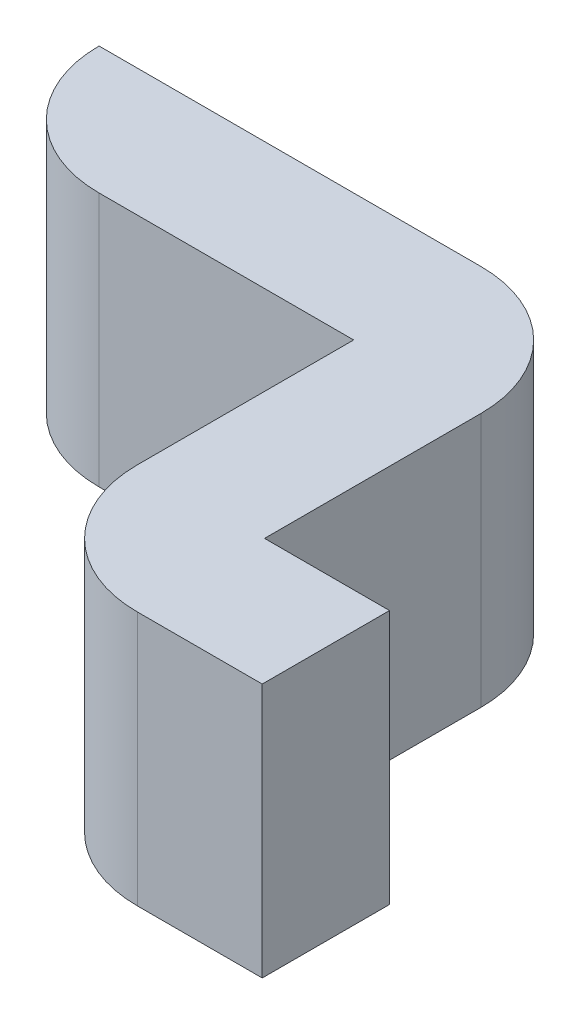
ISO-10303-21;
HEADER;
FILE_DESCRIPTION(('STEP AP214'),'2;1');
FILE_NAME('part.step','',(''),(''),'','','');
FILE_SCHEMA(('AUTOMOTIVE_DESIGN { 1 0 10303 214 1 1 1 1 }'));
ENDSEC;
DATA;
#1=APPLICATION_CONTEXT('core data for automotive mechanical design processes');
#2=APPLICATION_PROTOCOL_DEFINITION('international standard','automotive_design',2000,#1);
#3=PRODUCT_CONTEXT('',#1,'mechanical');
#4=PRODUCT('Part','Part','',(#3));
#5=PRODUCT_RELATED_PRODUCT_CATEGORY('part','',(#4));
#6=PRODUCT_DEFINITION_FORMATION('','',#4);
#7=PRODUCT_DEFINITION_CONTEXT('part definition',#1,'design');
#8=PRODUCT_DEFINITION('design','',#6,#7);
#9=PRODUCT_DEFINITION_SHAPE('','',#8);
#10=(LENGTH_UNIT() NAMED_UNIT(*) SI_UNIT(.MILLI.,.METRE.));
#11=(NAMED_UNIT(*) PLANE_ANGLE_UNIT() SI_UNIT($,.RADIAN.));
#12=(NAMED_UNIT(*) SI_UNIT($,.STERADIAN.) SOLID_ANGLE_UNIT());
#13=UNCERTAINTY_MEASURE_WITH_UNIT(LENGTH_MEASURE(1.E-05),#10,'distance_accuracy_value','');
#14=(GEOMETRIC_REPRESENTATION_CONTEXT(3) GLOBAL_UNCERTAINTY_ASSIGNED_CONTEXT((#13)) GLOBAL_UNIT_ASSIGNED_CONTEXT((#10,
#11,#12)) REPRESENTATION_CONTEXT('',''));
#15=CARTESIAN_POINT('',(0.,0.,0.));
#16=DIRECTION('',(0.,0.,1.));
#17=DIRECTION('',(1.,0.,0.));
#18=AXIS2_PLACEMENT_3D('',#15,#16,#17);
#19=CARTESIAN_POINT('',(-1.0287,-1.0922,0.));
#20=DIRECTION('',(0.,-1.,0.));
#21=DIRECTION('',(0.,0.,-1.));
#22=AXIS2_PLACEMENT_3D('',#19,#20,#21);
#23=PLANE('',#22);
#24=DIRECTION('',(-1.,0.,0.));
#25=VECTOR('',#24,1.);
#26=CARTESIAN_POINT('',(-0.9017,-1.0922,0.127));
#27=LINE('',#26,#25);
#28=CARTESIAN_POINT('',(-0.9017,-1.0922,0.127));
#29=VERTEX_POINT('',#28);
#30=CARTESIAN_POINT('',(-0.6477,-1.0922,0.127));
#31=VERTEX_POINT('',#30);
#32=EDGE_CURVE('E102',#29,#31,#27,.F.);
#33=ORIENTED_EDGE('',*,*,#32,.T.);
#34=DIRECTION('',(0.,0.,-1.));
#35=VECTOR('',#34,1.);
#36=CARTESIAN_POINT('',(-0.6477,-1.0922,0.127));
#37=LINE('',#36,#35);
#38=CARTESIAN_POINT('',(-0.6477,-1.0922,0.3429));
#39=VERTEX_POINT('',#38);
#40=EDGE_CURVE('E105',#31,#39,#37,.F.);
#41=ORIENTED_EDGE('',*,*,#40,.T.);
#42=CARTESIAN_POINT('',(-0.5207,-1.0922,0.3429));
#43=DIRECTION('',(0.,-1.,0.));
#44=DIRECTION('',(0.,0.,-1.));
#45=AXIS2_PLACEMENT_3D('',#42,#43,#44);
#46=CIRCLE('',#45,0.127);
#47=CARTESIAN_POINT('',(-0.5207,-1.0922,0.4699));
#48=VERTEX_POINT('',#47);
#49=EDGE_CURVE('E117',#48,#39,#46,.T.);
#50=ORIENTED_EDGE('',*,*,#49,.F.);
#51=DIRECTION('',(-1.,0.,0.));
#52=VECTOR('',#51,1.);
#53=CARTESIAN_POINT('',(-0.5207,-1.0922,0.4699));
#54=LINE('',#53,#52);
#55=CARTESIAN_POINT('',(-0.396,-1.0922,0.4699));
#56=VERTEX_POINT('',#55);
#57=EDGE_CURVE('E134',#48,#56,#54,.F.);
#58=ORIENTED_EDGE('',*,*,#57,.T.);
#59=DIRECTION('',(0.,0.,1.));
#60=VECTOR('',#59,1.);
#61=CARTESIAN_POINT('',(-0.396,-1.0922,0.4699));
#62=LINE('',#61,#60);
#63=CARTESIAN_POINT('',(-0.396,-1.0922,0.3429));
#64=VERTEX_POINT('',#63);
#65=EDGE_CURVE('E90',#56,#64,#62,.F.);
#66=ORIENTED_EDGE('',*,*,#65,.T.);
#67=DIRECTION('',(1.,0.,0.));
#68=VECTOR('',#67,1.);
#69=CARTESIAN_POINT('',(-0.396,-1.0922,0.3429));
#70=LINE('',#69,#68);
#71=CARTESIAN_POINT('',(-0.5207,-1.0922,0.3429));
#72=VERTEX_POINT('',#71);
#73=EDGE_CURVE('E87',#64,#72,#70,.F.);
#74=ORIENTED_EDGE('',*,*,#73,.T.);
#75=DIRECTION('',(0.,0.,1.));
#76=VECTOR('',#75,1.);
#77=CARTESIAN_POINT('',(-0.5207,-1.0922,0.3429));
#78=LINE('',#77,#76);
#79=CARTESIAN_POINT('',(-0.5207,-1.0922,0.127));
#80=VERTEX_POINT('',#79);
#81=EDGE_CURVE('E82',#72,#80,#78,.F.);
#82=ORIENTED_EDGE('',*,*,#81,.T.);
#83=CARTESIAN_POINT('',(-0.6477,-1.0922,0.127));
#84=DIRECTION('',(0.,-1.,0.));
#85=DIRECTION('',(0.,0.,-1.));
#86=AXIS2_PLACEMENT_3D('',#83,#84,#85);
#87=CIRCLE('',#86,0.127);
#88=CARTESIAN_POINT('',(-0.6477,-1.0922,0.));
#89=VERTEX_POINT('',#88);
#90=EDGE_CURVE('E20',#89,#80,#87,.T.);
#91=ORIENTED_EDGE('',*,*,#90,.F.);
#92=DIRECTION('',(1.,0.,0.));
#93=VECTOR('',#92,1.);
#94=CARTESIAN_POINT('',(-0.6477,-1.0922,0.));
#95=LINE('',#94,#93);
#96=CARTESIAN_POINT('',(-1.0287,-1.0922,0.));
#97=VERTEX_POINT('',#96);
#98=EDGE_CURVE('E76',#89,#97,#95,.F.);
#99=ORIENTED_EDGE('',*,*,#98,.T.);
#100=CARTESIAN_POINT('',(-0.9017,-1.0922,0.));
#101=DIRECTION('',(0.,-1.,0.));
#102=DIRECTION('',(0.,0.,-1.));
#103=AXIS2_PLACEMENT_3D('',#100,#101,#102);
#104=CIRCLE('',#103,0.127);
#105=EDGE_CURVE('E108',#29,#97,#104,.T.);
#106=ORIENTED_EDGE('',*,*,#105,.F.);
#107=EDGE_LOOP('',(#33,#41,#50,#58,#66,#74,#82,#91,#99,#106));
#108=FACE_BOUND('',#107,.T.);
#109=ADVANCED_FACE('F17',(#108),#23,.F.);
#110=CARTESIAN_POINT('',(-0.6477,-1.3462,0.));
#111=DIRECTION('',(0.,0.,1.));
#112=DIRECTION('',(1.,0.,0.));
#113=AXIS2_PLACEMENT_3D('',#110,#111,#112);
#114=PLANE('',#113);
#115=DIRECTION('',(0.,-1.,0.));
#116=VECTOR('',#115,1.);
#117=CARTESIAN_POINT('',(-1.0287,-1.3462,0.));
#118=LINE('',#117,#116);
#119=CARTESIAN_POINT('',(-1.0287,-1.3462,0.));
#120=VERTEX_POINT('',#119);
#121=EDGE_CURVE('E187',#97,#120,#118,.T.);
#122=ORIENTED_EDGE('',*,*,#121,.F.);
#123=ORIENTED_EDGE('',*,*,#98,.F.);
#124=DIRECTION('',(0.,-1.,0.));
#125=VECTOR('',#124,1.);
#126=CARTESIAN_POINT('',(-0.6477,-1.3462,0.));
#127=LINE('',#126,#125);
#128=CARTESIAN_POINT('',(-0.6477,-1.3462,0.));
#129=VERTEX_POINT('',#128);
#130=EDGE_CURVE('E159',#129,#89,#127,.F.);
#131=ORIENTED_EDGE('',*,*,#130,.F.);
#132=DIRECTION('',(1.,0.,0.));
#133=VECTOR('',#132,1.);
#134=CARTESIAN_POINT('',(-1.0287,-1.3462,0.));
#135=LINE('',#134,#133);
#136=EDGE_CURVE('E186',#120,#129,#135,.T.);
#137=ORIENTED_EDGE('',*,*,#136,.F.);
#138=EDGE_LOOP('',(#122,#123,#131,#137));
#139=FACE_BOUND('',#138,.T.);
#140=ADVANCED_FACE('F217',(#139),#114,.F.);
#141=CARTESIAN_POINT('',(-0.6477,-1.3462,0.127));
#142=DIRECTION('',(0.,-1.,0.));
#143=DIRECTION('',(0.,0.,-1.));
#144=AXIS2_PLACEMENT_3D('',#141,#142,#143);
#145=CYLINDRICAL_SURFACE('',#144,0.127);
#146=ORIENTED_EDGE('',*,*,#90,.T.);
#147=DIRECTION('',(0.,1.,0.));
#148=VECTOR('',#147,1.);
#149=CARTESIAN_POINT('',(-0.5207,-1.3462,0.127));
#150=LINE('',#149,#148);
#151=CARTESIAN_POINT('',(-0.5207,-1.3462,0.127));
#152=VERTEX_POINT('',#151);
#153=EDGE_CURVE('E157',#80,#152,#150,.F.);
#154=ORIENTED_EDGE('',*,*,#153,.T.);
#155=CARTESIAN_POINT('',(-0.6477,-1.3462,0.127));
#156=DIRECTION('',(0.,-1.,0.));
#157=DIRECTION('',(0.,0.,-1.));
#158=AXIS2_PLACEMENT_3D('',#155,#156,#157);
#159=CIRCLE('',#158,0.127);
#160=EDGE_CURVE('E183',#129,#152,#159,.T.);
#161=ORIENTED_EDGE('',*,*,#160,.F.);
#162=ORIENTED_EDGE('',*,*,#130,.T.);
#163=EDGE_LOOP('',(#146,#154,#161,#162));
#164=FACE_BOUND('',#163,.T.);
#165=ADVANCED_FACE('F214',(#164),#145,.T.);
#166=CARTESIAN_POINT('',(-0.5207,-1.3462,0.3429));
#167=DIRECTION('',(-1.,0.,0.));
#168=DIRECTION('',(0.,0.,1.));
#169=AXIS2_PLACEMENT_3D('',#166,#167,#168);
#170=PLANE('',#169);
#171=ORIENTED_EDGE('',*,*,#153,.F.);
#172=ORIENTED_EDGE('',*,*,#81,.F.);
#173=DIRECTION('',(0.,1.,0.));
#174=VECTOR('',#173,1.);
#175=CARTESIAN_POINT('',(-0.5207,-1.3462,0.3429));
#176=LINE('',#175,#174);
#177=CARTESIAN_POINT('',(-0.5207,-1.3462,0.3429));
#178=VERTEX_POINT('',#177);
#179=EDGE_CURVE('E153',#72,#178,#176,.F.);
#180=ORIENTED_EDGE('',*,*,#179,.T.);
#181=DIRECTION('',(0.,0.,-1.));
#182=VECTOR('',#181,1.);
#183=CARTESIAN_POINT('',(-0.5207,-1.3462,0.));
#184=LINE('',#183,#182);
#185=EDGE_CURVE('E150',#152,#178,#184,.F.);
#186=ORIENTED_EDGE('',*,*,#185,.F.);
#187=EDGE_LOOP('',(#171,#172,#180,#186));
#188=FACE_BOUND('',#187,.T.);
#189=ADVANCED_FACE('F211',(#188),#170,.F.);
#190=CARTESIAN_POINT('',(-0.396,-1.3462,0.3429));
#191=DIRECTION('',(0.,0.,1.));
#192=DIRECTION('',(1.,0.,0.));
#193=AXIS2_PLACEMENT_3D('',#190,#191,#192);
#194=PLANE('',#193);
#195=ORIENTED_EDGE('',*,*,#179,.F.);
#196=ORIENTED_EDGE('',*,*,#73,.F.);
#197=DIRECTION('',(0.,1.,0.));
#198=VECTOR('',#197,1.);
#199=CARTESIAN_POINT('',(-0.396,-1.3462,0.3429));
#200=LINE('',#199,#198);
#201=CARTESIAN_POINT('',(-0.396,-1.3462,0.3429));
#202=VERTEX_POINT('',#201);
#203=EDGE_CURVE('E144',#64,#202,#200,.F.);
#204=ORIENTED_EDGE('',*,*,#203,.T.);
#205=DIRECTION('',(1.,0.,0.));
#206=VECTOR('',#205,1.);
#207=CARTESIAN_POINT('',(-1.0287,-1.3462,0.3429));
#208=LINE('',#207,#206);
#209=EDGE_CURVE('E141',#178,#202,#208,.T.);
#210=ORIENTED_EDGE('',*,*,#209,.F.);
#211=EDGE_LOOP('',(#195,#196,#204,#210));
#212=FACE_BOUND('',#211,.T.);
#213=ADVANCED_FACE('F208',(#212),#194,.F.);
#214=CARTESIAN_POINT('',(-0.396,-1.3462,0.4699));
#215=DIRECTION('',(-1.,0.,0.));
#216=DIRECTION('',(0.,0.,1.));
#217=AXIS2_PLACEMENT_3D('',#214,#215,#216);
#218=PLANE('',#217);
#219=ORIENTED_EDGE('',*,*,#203,.F.);
#220=ORIENTED_EDGE('',*,*,#65,.F.);
#221=DIRECTION('',(0.,1.,0.));
#222=VECTOR('',#221,1.);
#223=CARTESIAN_POINT('',(-0.396,-1.3462,0.4699));
#224=LINE('',#223,#222);
#225=CARTESIAN_POINT('',(-0.396,-1.3462,0.4699));
#226=VERTEX_POINT('',#225);
#227=EDGE_CURVE('E132',#56,#226,#224,.F.);
#228=ORIENTED_EDGE('',*,*,#227,.T.);
#229=DIRECTION('',(0.,0.,-1.));
#230=VECTOR('',#229,1.);
#231=CARTESIAN_POINT('',(-0.396,-1.3462,0.));
#232=LINE('',#231,#230);
#233=EDGE_CURVE('E137',#202,#226,#232,.F.);
#234=ORIENTED_EDGE('',*,*,#233,.F.);
#235=EDGE_LOOP('',(#219,#220,#228,#234));
#236=FACE_BOUND('',#235,.T.);
#237=ADVANCED_FACE('F195',(#236),#218,.F.);
#238=CARTESIAN_POINT('',(-0.5207,-1.3462,0.4699));
#239=DIRECTION('',(0.,0.,-1.));
#240=DIRECTION('',(-1.,0.,0.));
#241=AXIS2_PLACEMENT_3D('',#238,#239,#240);
#242=PLANE('',#241);
#243=ORIENTED_EDGE('',*,*,#227,.F.);
#244=ORIENTED_EDGE('',*,*,#57,.F.);
#245=DIRECTION('',(0.,-1.,0.));
#246=VECTOR('',#245,1.);
#247=CARTESIAN_POINT('',(-0.5207,-1.3462,0.4699));
#248=LINE('',#247,#246);
#249=CARTESIAN_POINT('',(-0.5207,-1.3462,0.4699));
#250=VERTEX_POINT('',#249);
#251=EDGE_CURVE('E129',#250,#48,#248,.F.);
#252=ORIENTED_EDGE('',*,*,#251,.F.);
#253=DIRECTION('',(1.,0.,0.));
#254=VECTOR('',#253,1.);
#255=CARTESIAN_POINT('',(-1.0287,-1.3462,0.4699));
#256=LINE('',#255,#254);
#257=EDGE_CURVE('E140',#226,#250,#256,.F.);
#258=ORIENTED_EDGE('',*,*,#257,.F.);
#259=EDGE_LOOP('',(#243,#244,#252,#258));
#260=FACE_BOUND('',#259,.T.);
#261=ADVANCED_FACE('F198',(#260),#242,.F.);
#262=CARTESIAN_POINT('',(-0.5207,-1.3462,0.3429));
#263=DIRECTION('',(0.,-1.,0.));
#264=DIRECTION('',(0.,0.,-1.));
#265=AXIS2_PLACEMENT_3D('',#262,#263,#264);
#266=CYLINDRICAL_SURFACE('',#265,0.127);
#267=ORIENTED_EDGE('',*,*,#49,.T.);
#268=DIRECTION('',(0.,1.,0.));
#269=VECTOR('',#268,1.);
#270=CARTESIAN_POINT('',(-0.6477,-1.3462,0.3429));
#271=LINE('',#270,#269);
#272=CARTESIAN_POINT('',(-0.6477,-1.3462,0.3429));
#273=VERTEX_POINT('',#272);
#274=EDGE_CURVE('E111',#39,#273,#271,.F.);
#275=ORIENTED_EDGE('',*,*,#274,.T.);
#276=CARTESIAN_POINT('',(-0.5207,-1.3462,0.3429));
#277=DIRECTION('',(0.,-1.,0.));
#278=DIRECTION('',(0.,0.,-1.));
#279=AXIS2_PLACEMENT_3D('',#276,#277,#278);
#280=CIRCLE('',#279,0.127);
#281=EDGE_CURVE('E179',#250,#273,#280,.T.);
#282=ORIENTED_EDGE('',*,*,#281,.F.);
#283=ORIENTED_EDGE('',*,*,#251,.T.);
#284=EDGE_LOOP('',(#267,#275,#282,#283));
#285=FACE_BOUND('',#284,.T.);
#286=ADVANCED_FACE('F189',(#285),#266,.T.);
#287=CARTESIAN_POINT('',(-0.6477,-1.3462,0.127));
#288=DIRECTION('',(1.,0.,0.));
#289=DIRECTION('',(0.,0.,-1.));
#290=AXIS2_PLACEMENT_3D('',#287,#288,#289);
#291=PLANE('',#290);
#292=ORIENTED_EDGE('',*,*,#274,.F.);
#293=ORIENTED_EDGE('',*,*,#40,.F.);
#294=DIRECTION('',(0.,1.,0.));
#295=VECTOR('',#294,1.);
#296=CARTESIAN_POINT('',(-0.6477,-1.3462,0.127));
#297=LINE('',#296,#295);
#298=CARTESIAN_POINT('',(-0.6477,-1.3462,0.127));
#299=VERTEX_POINT('',#298);
#300=EDGE_CURVE('E110',#31,#299,#297,.F.);
#301=ORIENTED_EDGE('',*,*,#300,.T.);
#302=DIRECTION('',(0.,0.,-1.));
#303=VECTOR('',#302,1.);
#304=CARTESIAN_POINT('',(-0.6477,-1.3462,0.));
#305=LINE('',#304,#303);
#306=EDGE_CURVE('E182',#273,#299,#305,.T.);
#307=ORIENTED_EDGE('',*,*,#306,.F.);
#308=EDGE_LOOP('',(#292,#293,#301,#307));
#309=FACE_BOUND('',#308,.T.);
#310=ADVANCED_FACE('F115',(#309),#291,.F.);
#311=CARTESIAN_POINT('',(-0.9017,-1.3462,0.127));
#312=DIRECTION('',(0.,0.,-1.));
#313=DIRECTION('',(-1.,0.,0.));
#314=AXIS2_PLACEMENT_3D('',#311,#312,#313);
#315=PLANE('',#314);
#316=ORIENTED_EDGE('',*,*,#300,.F.);
#317=ORIENTED_EDGE('',*,*,#32,.F.);
#318=DIRECTION('',(0.,-1.,0.));
#319=VECTOR('',#318,1.);
#320=CARTESIAN_POINT('',(-0.9017,-1.3462,0.127));
#321=LINE('',#320,#319);
#322=CARTESIAN_POINT('',(-0.9017,-1.3462,0.127));
#323=VERTEX_POINT('',#322);
#324=EDGE_CURVE('E35',#323,#29,#321,.F.);
#325=ORIENTED_EDGE('',*,*,#324,.F.);
#326=DIRECTION('',(1.,0.,0.));
#327=VECTOR('',#326,1.);
#328=CARTESIAN_POINT('',(-1.0287,-1.3462,0.127));
#329=LINE('',#328,#327);
#330=EDGE_CURVE('E26',#299,#323,#329,.F.);
#331=ORIENTED_EDGE('',*,*,#330,.F.);
#332=EDGE_LOOP('',(#316,#317,#325,#331));
#333=FACE_BOUND('',#332,.T.);
#334=ADVANCED_FACE('F119',(#333),#315,.F.);
#335=CARTESIAN_POINT('',(-0.9017,-1.3462,0.));
#336=DIRECTION('',(0.,-1.,0.));
#337=DIRECTION('',(0.,0.,-1.));
#338=AXIS2_PLACEMENT_3D('',#335,#336,#337);
#339=CYLINDRICAL_SURFACE('',#338,0.127);
#340=ORIENTED_EDGE('',*,*,#105,.T.);
#341=ORIENTED_EDGE('',*,*,#121,.T.);
#342=CARTESIAN_POINT('',(-0.9017,-1.3462,0.));
#343=DIRECTION('',(0.,-1.,0.));
#344=DIRECTION('',(0.,0.,-1.));
#345=AXIS2_PLACEMENT_3D('',#342,#343,#344);
#346=CIRCLE('',#345,0.127);
#347=EDGE_CURVE('E11',#323,#120,#346,.T.);
#348=ORIENTED_EDGE('',*,*,#347,.F.);
#349=ORIENTED_EDGE('',*,*,#324,.T.);
#350=EDGE_LOOP('',(#340,#341,#348,#349));
#351=FACE_BOUND('',#350,.T.);
#352=ADVANCED_FACE('F219',(#351),#339,.T.);
#353=CARTESIAN_POINT('',(-1.0287,-1.3462,0.));
#354=DIRECTION('',(0.,-1.,0.));
#355=DIRECTION('',(0.,0.,-1.));
#356=AXIS2_PLACEMENT_3D('',#353,#354,#355);
#357=PLANE('',#356);
#358=ORIENTED_EDGE('',*,*,#330,.T.);
#359=ORIENTED_EDGE('',*,*,#347,.T.);
#360=ORIENTED_EDGE('',*,*,#136,.T.);
#361=ORIENTED_EDGE('',*,*,#160,.T.);
#362=ORIENTED_EDGE('',*,*,#185,.T.);
#363=ORIENTED_EDGE('',*,*,#209,.T.);
#364=ORIENTED_EDGE('',*,*,#233,.T.);
#365=ORIENTED_EDGE('',*,*,#257,.T.);
#366=ORIENTED_EDGE('',*,*,#281,.T.);
#367=ORIENTED_EDGE('',*,*,#306,.T.);
#368=EDGE_LOOP('',(#358,#359,#360,#361,#362,#363,#364,#365,#366,#367));
#369=FACE_BOUND('',#368,.T.);
#370=ADVANCED_FACE('F202',(#369),#357,.T.);
#371=CLOSED_SHELL('',(#109,#140,#165,#189,#213,#237,#261,#286,#310,#334,#352,#370));
#372=MANIFOLD_SOLID_BREP('B1',#371);
#373=ADVANCED_BREP_SHAPE_REPRESENTATION('',(#18,#372),#14);
#374=SHAPE_DEFINITION_REPRESENTATION(#9,#373);
ENDSEC;
END-ISO-10303-21;
